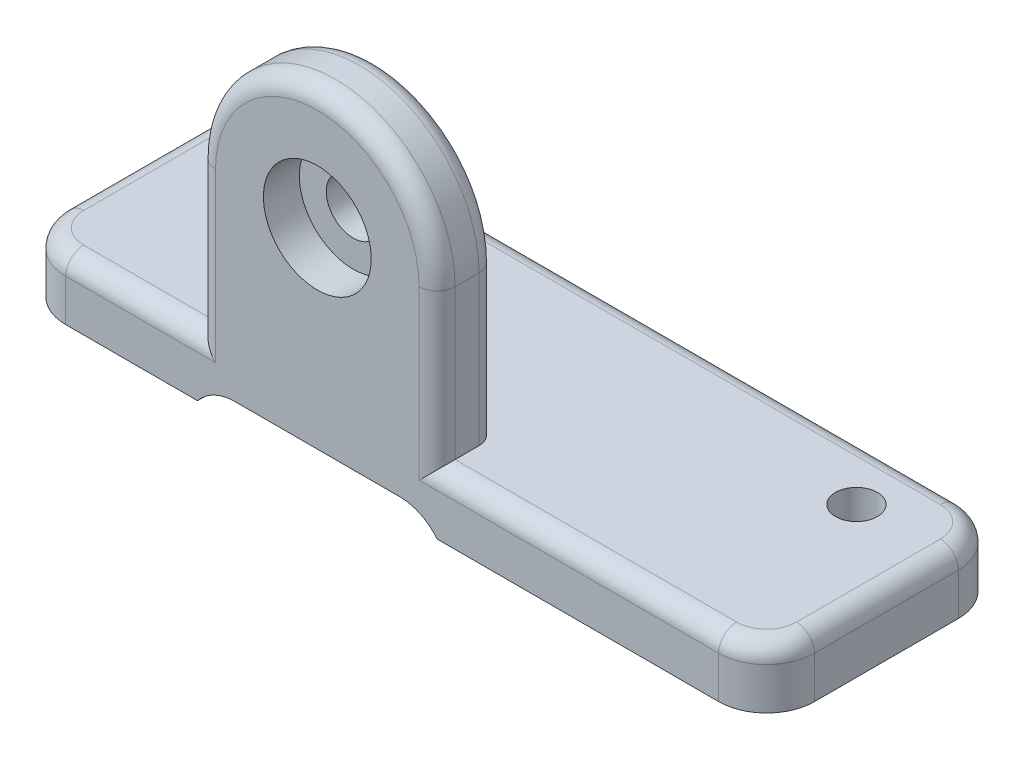
ISO-10303-21;
HEADER;
FILE_DESCRIPTION(('STEP AP214'),'2;1');
FILE_NAME('part.step','',(''),(''),'','','');
FILE_SCHEMA(('AUTOMOTIVE_DESIGN { 1 0 10303 214 1 1 1 1 }'));
ENDSEC;
DATA;
#1=APPLICATION_CONTEXT('core data for automotive mechanical design processes');
#2=APPLICATION_PROTOCOL_DEFINITION('international standard','automotive_design',2000,#1);
#3=PRODUCT_CONTEXT('',#1,'mechanical');
#4=PRODUCT('Part','Part','',(#3));
#5=PRODUCT_RELATED_PRODUCT_CATEGORY('part','',(#4));
#6=PRODUCT_DEFINITION_FORMATION('','',#4);
#7=PRODUCT_DEFINITION_CONTEXT('part definition',#1,'design');
#8=PRODUCT_DEFINITION('design','',#6,#7);
#9=PRODUCT_DEFINITION_SHAPE('','',#8);
#10=(LENGTH_UNIT() NAMED_UNIT(*) SI_UNIT(.MILLI.,.METRE.));
#11=(NAMED_UNIT(*) PLANE_ANGLE_UNIT() SI_UNIT($,.RADIAN.));
#12=(NAMED_UNIT(*) SI_UNIT($,.STERADIAN.) SOLID_ANGLE_UNIT());
#13=UNCERTAINTY_MEASURE_WITH_UNIT(LENGTH_MEASURE(1.E-05),#10,'distance_accuracy_value','');
#14=(GEOMETRIC_REPRESENTATION_CONTEXT(3) GLOBAL_UNCERTAINTY_ASSIGNED_CONTEXT((#13)) GLOBAL_UNIT_ASSIGNED_CONTEXT((#10,
#11,#12)) REPRESENTATION_CONTEXT('',''));
#15=CARTESIAN_POINT('',(0.,0.,0.));
#16=DIRECTION('',(0.,0.,1.));
#17=DIRECTION('',(1.,0.,0.));
#18=AXIS2_PLACEMENT_3D('',#15,#16,#17);
#19=CARTESIAN_POINT('',(0.,0.,40.));
#20=DIRECTION('',(0.,-1.,0.));
#21=DIRECTION('',(0.,0.,-1.));
#22=AXIS2_PLACEMENT_3D('',#19,#20,#21);
#23=PLANE('',#22);
#24=CARTESIAN_POINT('',(-15.,0.,10.));
#25=DIRECTION('',(0.,1.,0.));
#26=DIRECTION('',(0.,0.,1.));
#27=AXIS2_PLACEMENT_3D('',#24,#25,#26);
#28=CIRCLE('',#27,3.5);
#29=CARTESIAN_POINT('',(-15.,0.,13.5));
#30=VERTEX_POINT('',#29);
#31=EDGE_CURVE('E843',#30,#30,#28,.T.);
#32=ORIENTED_EDGE('',*,*,#31,.F.);
#33=EDGE_LOOP('',(#32));
#34=FACE_BOUND('',#33,.T.);
#35=CARTESIAN_POINT('',(-110.,0.,10.));
#36=DIRECTION('',(0.,1.,0.));
#37=DIRECTION('',(0.,0.,1.));
#38=AXIS2_PLACEMENT_3D('',#35,#36,#37);
#39=CIRCLE('',#38,3.50000000000001);
#40=CARTESIAN_POINT('',(-110.,0.,13.5));
#41=VERTEX_POINT('',#40);
#42=EDGE_CURVE('E840',#41,#41,#39,.T.);
#43=ORIENTED_EDGE('',*,*,#42,.F.);
#44=EDGE_LOOP('',(#43));
#45=FACE_BOUND('',#44,.T.);
#46=DIRECTION('',(0.,0.,-1.));
#47=VECTOR('',#46,1.);
#48=CARTESIAN_POINT('',(-55.,0.,40.));
#49=LINE('',#48,#47);
#50=CARTESIAN_POINT('',(-55.,0.,37.));
#51=VERTEX_POINT('',#50);
#52=CARTESIAN_POINT('',(-55.,0.,33.));
#53=VERTEX_POINT('',#52);
#54=EDGE_CURVE('E410',#51,#53,#49,.T.);
#55=ORIENTED_EDGE('',*,*,#54,.F.);
#56=DIRECTION('',(-1.,0.,0.));
#57=VECTOR('',#56,1.);
#58=CARTESIAN_POINT('',(-8.,0.,37.));
#59=LINE('',#58,#57);
#60=CARTESIAN_POINT('',(-8.,0.,37.));
#61=VERTEX_POINT('',#60);
#62=EDGE_CURVE('E331',#51,#61,#59,.F.);
#63=ORIENTED_EDGE('',*,*,#62,.T.);
#64=CARTESIAN_POINT('',(-8.,0.,32.));
#65=DIRECTION('',(0.,-1.,0.));
#66=DIRECTION('',(0.,0.,-1.));
#67=AXIS2_PLACEMENT_3D('',#64,#65,#66);
#68=CIRCLE('',#67,5.);
#69=CARTESIAN_POINT('',(-3.,0.,32.));
#70=VERTEX_POINT('',#69);
#71=EDGE_CURVE('E329',#61,#70,#68,.F.);
#72=ORIENTED_EDGE('',*,*,#71,.T.);
#73=DIRECTION('',(0.,0.,-1.));
#74=VECTOR('',#73,1.);
#75=CARTESIAN_POINT('',(-3.,0.,40.));
#76=LINE('',#75,#74);
#77=CARTESIAN_POINT('',(-3.,0.,8.));
#78=VERTEX_POINT('',#77);
#79=EDGE_CURVE('E327',#70,#78,#76,.T.);
#80=ORIENTED_EDGE('',*,*,#79,.T.);
#81=CARTESIAN_POINT('',(-8.,0.,8.));
#82=DIRECTION('',(0.,-1.,0.));
#83=DIRECTION('',(0.,0.,-1.));
#84=AXIS2_PLACEMENT_3D('',#81,#82,#83);
#85=CIRCLE('',#84,5.);
#86=CARTESIAN_POINT('',(-8.,0.,3.));
#87=VERTEX_POINT('',#86);
#88=EDGE_CURVE('E325',#78,#87,#85,.F.);
#89=ORIENTED_EDGE('',*,*,#88,.T.);
#90=DIRECTION('',(-1.,0.,0.));
#91=VECTOR('',#90,1.);
#92=CARTESIAN_POINT('',(0.,0.,3.));
#93=LINE('',#92,#91);
#94=CARTESIAN_POINT('',(-117.,0.,3.));
#95=VERTEX_POINT('',#94);
#96=EDGE_CURVE('E323',#87,#95,#93,.T.);
#97=ORIENTED_EDGE('',*,*,#96,.T.);
#98=CARTESIAN_POINT('',(-117.,0.,8.));
#99=DIRECTION('',(0.,-1.,0.));
#100=DIRECTION('',(0.,0.,-1.));
#101=AXIS2_PLACEMENT_3D('',#98,#99,#100);
#102=CIRCLE('',#101,5.);
#103=CARTESIAN_POINT('',(-122.,0.,8.));
#104=VERTEX_POINT('',#103);
#105=EDGE_CURVE('E321',#95,#104,#102,.F.);
#106=ORIENTED_EDGE('',*,*,#105,.T.);
#107=DIRECTION('',(0.,0.,-1.));
#108=VECTOR('',#107,1.);
#109=CARTESIAN_POINT('',(-122.,0.,40.));
#110=LINE('',#109,#108);
#111=CARTESIAN_POINT('',(-122.,0.,32.));
#112=VERTEX_POINT('',#111);
#113=EDGE_CURVE('E319',#104,#112,#110,.F.);
#114=ORIENTED_EDGE('',*,*,#113,.T.);
#115=CARTESIAN_POINT('',(-117.,0.,32.));
#116=DIRECTION('',(0.,-1.,0.));
#117=DIRECTION('',(0.,0.,-1.));
#118=AXIS2_PLACEMENT_3D('',#115,#116,#117);
#119=CIRCLE('',#118,5.);
#120=CARTESIAN_POINT('',(-117.,0.,37.));
#121=VERTEX_POINT('',#120);
#122=EDGE_CURVE('E317',#112,#121,#119,.F.);
#123=ORIENTED_EDGE('',*,*,#122,.T.);
#124=DIRECTION('',(-1.,0.,0.));
#125=VECTOR('',#124,1.);
#126=CARTESIAN_POINT('',(-95.,0.,37.));
#127=LINE('',#126,#125);
#128=CARTESIAN_POINT('',(-95.,0.,37.));
#129=VERTEX_POINT('',#128);
#130=EDGE_CURVE('E315',#121,#129,#127,.F.);
#131=ORIENTED_EDGE('',*,*,#130,.T.);
#132=DIRECTION('',(0.,0.,1.));
#133=VECTOR('',#132,1.);
#134=CARTESIAN_POINT('',(-95.,0.,40.));
#135=LINE('',#134,#133);
#136=CARTESIAN_POINT('',(-95.,0.,33.));
#137=VERTEX_POINT('',#136);
#138=EDGE_CURVE('E414',#137,#129,#135,.T.);
#139=ORIENTED_EDGE('',*,*,#138,.F.);
#140=CARTESIAN_POINT('',(-92.,0.,33.));
#141=DIRECTION('',(0.,-1.,0.));
#142=DIRECTION('',(0.,0.,-1.));
#143=AXIS2_PLACEMENT_3D('',#140,#141,#142);
#144=CIRCLE('',#143,3.);
#145=CARTESIAN_POINT('',(-92.,0.,30.));
#146=VERTEX_POINT('',#145);
#147=EDGE_CURVE('E225',#137,#146,#144,.T.);
#148=ORIENTED_EDGE('',*,*,#147,.T.);
#149=DIRECTION('',(-1.,0.,0.));
#150=VECTOR('',#149,1.);
#151=CARTESIAN_POINT('',(-95.,0.,30.));
#152=LINE('',#151,#150);
#153=CARTESIAN_POINT('',(-58.,0.,30.));
#154=VERTEX_POINT('',#153);
#155=EDGE_CURVE('E404',#154,#146,#152,.T.);
#156=ORIENTED_EDGE('',*,*,#155,.F.);
#157=CARTESIAN_POINT('',(-58.,0.,33.));
#158=DIRECTION('',(0.,-1.,0.));
#159=DIRECTION('',(0.,0.,-1.));
#160=AXIS2_PLACEMENT_3D('',#157,#158,#159);
#161=CIRCLE('',#160,3.);
#162=EDGE_CURVE('E221',#154,#53,#161,.T.);
#163=ORIENTED_EDGE('',*,*,#162,.T.);
#164=EDGE_LOOP('',(#55,#63,#72,#80,#89,#97,#106,#114,#123,#131,#139,#148,#156,#163));
#165=FACE_BOUND('',#164,.T.);
#166=ADVANCED_FACE('F38',(#34,#45,#165),#23,.F.);
#167=CARTESIAN_POINT('',(-125.,0.,40.));
#168=DIRECTION('',(1.,0.,0.));
#169=DIRECTION('',(0.,0.,-1.));
#170=AXIS2_PLACEMENT_3D('',#167,#168,#169);
#171=PLANE('',#170);
#172=DIRECTION('',(0.,-1.,0.));
#173=VECTOR('',#172,1.);
#174=CARTESIAN_POINT('',(-125.,0.,32.));
#175=LINE('',#174,#173);
#176=CARTESIAN_POINT('',(-125.,-10.,32.));
#177=VERTEX_POINT('',#176);
#178=CARTESIAN_POINT('',(-125.,-3.,32.));
#179=VERTEX_POINT('',#178);
#180=EDGE_CURVE('E281',#177,#179,#175,.F.);
#181=ORIENTED_EDGE('',*,*,#180,.T.);
#182=DIRECTION('',(0.,0.,-1.));
#183=VECTOR('',#182,1.);
#184=CARTESIAN_POINT('',(-125.,-3.,40.));
#185=LINE('',#184,#183);
#186=CARTESIAN_POINT('',(-125.,-3.,8.));
#187=VERTEX_POINT('',#186);
#188=EDGE_CURVE('E343',#179,#187,#185,.T.);
#189=ORIENTED_EDGE('',*,*,#188,.T.);
#190=DIRECTION('',(0.,-1.,0.));
#191=VECTOR('',#190,1.);
#192=CARTESIAN_POINT('',(-125.,0.,8.));
#193=LINE('',#192,#191);
#194=CARTESIAN_POINT('',(-125.,-10.,8.));
#195=VERTEX_POINT('',#194);
#196=EDGE_CURVE('E279',#187,#195,#193,.T.);
#197=ORIENTED_EDGE('',*,*,#196,.T.);
#198=DIRECTION('',(0.,0.,-1.));
#199=VECTOR('',#198,1.);
#200=CARTESIAN_POINT('',(-125.,-10.,40.));
#201=LINE('',#200,#199);
#202=EDGE_CURVE('E214',#177,#195,#201,.T.);
#203=ORIENTED_EDGE('',*,*,#202,.F.);
#204=EDGE_LOOP('',(#181,#189,#197,#203));
#205=FACE_BOUND('',#204,.T.);
#206=ADVANCED_FACE('F474',(#205),#171,.F.);
#207=CARTESIAN_POINT('',(-125.,-10.,40.));
#208=DIRECTION('',(0.,1.,0.));
#209=DIRECTION('',(0.,0.,1.));
#210=AXIS2_PLACEMENT_3D('',#207,#208,#209);
#211=PLANE('',#210);
#212=CARTESIAN_POINT('',(-110.,-10.,10.));
#213=DIRECTION('',(0.,1.,0.));
#214=DIRECTION('',(0.,0.,1.));
#215=AXIS2_PLACEMENT_3D('',#212,#213,#214);
#216=CIRCLE('',#215,3.50000000000001);
#217=CARTESIAN_POINT('',(-110.,-10.,13.5));
#218=VERTEX_POINT('',#217);
#219=EDGE_CURVE('E381',#218,#218,#216,.T.);
#220=ORIENTED_EDGE('',*,*,#219,.T.);
#221=EDGE_LOOP('',(#220));
#222=FACE_BOUND('',#221,.T.);
#223=DIRECTION('',(1.,0.,0.));
#224=VECTOR('',#223,1.);
#225=CARTESIAN_POINT('',(-125.,-10.,40.));
#226=LINE('',#225,#224);
#227=CARTESIAN_POINT('',(-117.,-10.,40.));
#228=VERTEX_POINT('',#227);
#229=CARTESIAN_POINT('',(-95.,-10.,40.));
#230=VERTEX_POINT('',#229);
#231=EDGE_CURVE('E196',#228,#230,#226,.T.);
#232=ORIENTED_EDGE('',*,*,#231,.F.);
#233=CARTESIAN_POINT('',(-117.,-10.,32.));
#234=DIRECTION('',(0.,1.,0.));
#235=DIRECTION('',(0.,0.,1.));
#236=AXIS2_PLACEMENT_3D('',#233,#234,#235);
#237=CIRCLE('',#236,8.);
#238=EDGE_CURVE('E277',#228,#177,#237,.F.);
#239=ORIENTED_EDGE('',*,*,#238,.T.);
#240=ORIENTED_EDGE('',*,*,#202,.T.);
#241=CARTESIAN_POINT('',(-117.,-10.,8.));
#242=DIRECTION('',(0.,1.,0.));
#243=DIRECTION('',(0.,0.,1.));
#244=AXIS2_PLACEMENT_3D('',#241,#242,#243);
#245=CIRCLE('',#244,8.);
#246=CARTESIAN_POINT('',(-117.,-10.,0.));
#247=VERTEX_POINT('',#246);
#248=EDGE_CURVE('E275',#195,#247,#245,.F.);
#249=ORIENTED_EDGE('',*,*,#248,.T.);
#250=DIRECTION('',(1.,0.,0.));
#251=VECTOR('',#250,1.);
#252=CARTESIAN_POINT('',(-125.,-10.,0.));
#253=LINE('',#252,#251);
#254=CARTESIAN_POINT('',(-95.,-10.,0.));
#255=VERTEX_POINT('',#254);
#256=EDGE_CURVE('E212',#247,#255,#253,.T.);
#257=ORIENTED_EDGE('',*,*,#256,.T.);
#258=DIRECTION('',(0.,0.,-1.));
#259=VECTOR('',#258,1.);
#260=CARTESIAN_POINT('',(-95.,-10.,40.));
#261=LINE('',#260,#259);
#262=EDGE_CURVE('E209',#230,#255,#261,.T.);
#263=ORIENTED_EDGE('',*,*,#262,.F.);
#264=EDGE_LOOP('',(#232,#239,#240,#249,#257,#263));
#265=FACE_BOUND('',#264,.T.);
#266=ADVANCED_FACE('F210',(#222,#265),#211,.F.);
#267=CARTESIAN_POINT('',(-95.,-7.,40.));
#268=DIRECTION('',(0.,1.,0.));
#269=DIRECTION('',(-1.,0.,0.));
#270=AXIS2_PLACEMENT_3D('',#267,#268,#269);
#271=PLANE('',#270);
#272=DIRECTION('',(1.,0.,0.));
#273=VECTOR('',#272,1.);
#274=CARTESIAN_POINT('',(-95.,-7.,0.));
#275=LINE('',#274,#273);
#276=CARTESIAN_POINT('',(-88.7550020016016,-7.,0.));
#277=VERTEX_POINT('',#276);
#278=CARTESIAN_POINT('',(-61.2449979983984,-7.,0.));
#279=VERTEX_POINT('',#278);
#280=EDGE_CURVE('E237',#277,#279,#275,.T.);
#281=ORIENTED_EDGE('',*,*,#280,.T.);
#282=DIRECTION('',(0.,0.,1.));
#283=VECTOR('',#282,1.);
#284=CARTESIAN_POINT('',(-61.2449979983984,-7.,40.));
#285=LINE('',#284,#283);
#286=CARTESIAN_POINT('',(-61.2449979983984,-7.,40.));
#287=VERTEX_POINT('',#286);
#288=EDGE_CURVE('E53',#279,#287,#285,.T.);
#289=ORIENTED_EDGE('',*,*,#288,.T.);
#290=DIRECTION('',(1.,0.,0.));
#291=VECTOR('',#290,1.);
#292=CARTESIAN_POINT('',(-95.,-7.,40.));
#293=LINE('',#292,#291);
#294=CARTESIAN_POINT('',(-88.7550020016016,-7.,40.));
#295=VERTEX_POINT('',#294);
#296=EDGE_CURVE('E204',#295,#287,#293,.T.);
#297=ORIENTED_EDGE('',*,*,#296,.F.);
#298=DIRECTION('',(0.,0.,-1.));
#299=VECTOR('',#298,1.);
#300=CARTESIAN_POINT('',(-88.7550020016016,-7.,40.));
#301=LINE('',#300,#299);
#302=EDGE_CURVE('E219',#295,#277,#301,.T.);
#303=ORIENTED_EDGE('',*,*,#302,.T.);
#304=EDGE_LOOP('',(#281,#289,#297,#303));
#305=FACE_BOUND('',#304,.T.);
#306=ADVANCED_FACE('F531',(#305),#271,.F.);
#307=CARTESIAN_POINT('',(-55.,-10.,40.));
#308=DIRECTION('',(0.,1.,0.));
#309=DIRECTION('',(-1.,0.,0.));
#310=AXIS2_PLACEMENT_3D('',#307,#308,#309);
#311=PLANE('',#310);
#312=CARTESIAN_POINT('',(-15.,-10.,10.));
#313=DIRECTION('',(0.,1.,0.));
#314=DIRECTION('',(0.,0.,1.));
#315=AXIS2_PLACEMENT_3D('',#312,#313,#314);
#316=CIRCLE('',#315,3.5);
#317=CARTESIAN_POINT('',(-15.,-10.,13.5));
#318=VERTEX_POINT('',#317);
#319=EDGE_CURVE('E837',#318,#318,#316,.T.);
#320=ORIENTED_EDGE('',*,*,#319,.T.);
#321=EDGE_LOOP('',(#320));
#322=FACE_BOUND('',#321,.T.);
#323=DIRECTION('',(1.,0.,0.));
#324=VECTOR('',#323,1.);
#325=CARTESIAN_POINT('',(-55.,-10.,0.));
#326=LINE('',#325,#324);
#327=CARTESIAN_POINT('',(-55.,-10.,0.));
#328=VERTEX_POINT('',#327);
#329=CARTESIAN_POINT('',(-8.,-10.,0.));
#330=VERTEX_POINT('',#329);
#331=EDGE_CURVE('E205',#328,#330,#326,.T.);
#332=ORIENTED_EDGE('',*,*,#331,.T.);
#333=CARTESIAN_POINT('',(-8.,-10.,8.));
#334=DIRECTION('',(0.,1.,0.));
#335=DIRECTION('',(-1.,0.,0.));
#336=AXIS2_PLACEMENT_3D('',#333,#334,#335);
#337=CIRCLE('',#336,8.);
#338=CARTESIAN_POINT('',(0.,-10.,8.));
#339=VERTEX_POINT('',#338);
#340=EDGE_CURVE('E270',#330,#339,#337,.F.);
#341=ORIENTED_EDGE('',*,*,#340,.T.);
#342=DIRECTION('',(0.,0.,-1.));
#343=VECTOR('',#342,1.);
#344=CARTESIAN_POINT('',(0.,-10.,40.));
#345=LINE('',#344,#343);
#346=CARTESIAN_POINT('',(0.,-10.,32.));
#347=VERTEX_POINT('',#346);
#348=EDGE_CURVE('E246',#347,#339,#345,.T.);
#349=ORIENTED_EDGE('',*,*,#348,.F.);
#350=CARTESIAN_POINT('',(-8.,-10.,32.));
#351=DIRECTION('',(0.,1.,0.));
#352=DIRECTION('',(-1.,0.,0.));
#353=AXIS2_PLACEMENT_3D('',#350,#351,#352);
#354=CIRCLE('',#353,8.);
#355=CARTESIAN_POINT('',(-8.,-10.,40.));
#356=VERTEX_POINT('',#355);
#357=EDGE_CURVE('E268',#347,#356,#354,.F.);
#358=ORIENTED_EDGE('',*,*,#357,.T.);
#359=DIRECTION('',(1.,0.,0.));
#360=VECTOR('',#359,1.);
#361=CARTESIAN_POINT('',(-55.,-10.,40.));
#362=LINE('',#361,#360);
#363=CARTESIAN_POINT('',(-55.,-10.,40.));
#364=VERTEX_POINT('',#363);
#365=EDGE_CURVE('E249',#364,#356,#362,.T.);
#366=ORIENTED_EDGE('',*,*,#365,.F.);
#367=DIRECTION('',(0.,0.,-1.));
#368=VECTOR('',#367,1.);
#369=CARTESIAN_POINT('',(-55.,-10.,40.));
#370=LINE('',#369,#368);
#371=EDGE_CURVE('E215',#364,#328,#370,.T.);
#372=ORIENTED_EDGE('',*,*,#371,.T.);
#373=EDGE_LOOP('',(#332,#341,#349,#358,#366,#372));
#374=FACE_BOUND('',#373,.T.);
#375=ADVANCED_FACE('F496',(#322,#374),#311,.F.);
#376=CARTESIAN_POINT('',(0.,-10.,40.));
#377=DIRECTION('',(-1.,0.,0.));
#378=DIRECTION('',(0.,0.,1.));
#379=AXIS2_PLACEMENT_3D('',#376,#377,#378);
#380=PLANE('',#379);
#381=DIRECTION('',(0.,1.,0.));
#382=VECTOR('',#381,1.);
#383=CARTESIAN_POINT('',(0.,-10.,8.));
#384=LINE('',#383,#382);
#385=CARTESIAN_POINT('',(0.,-3.,8.));
#386=VERTEX_POINT('',#385);
#387=EDGE_CURVE('E261',#339,#386,#384,.T.);
#388=ORIENTED_EDGE('',*,*,#387,.T.);
#389=DIRECTION('',(0.,0.,-1.));
#390=VECTOR('',#389,1.);
#391=CARTESIAN_POINT('',(0.,-3.,40.));
#392=LINE('',#391,#390);
#393=CARTESIAN_POINT('',(0.,-3.,32.));
#394=VERTEX_POINT('',#393);
#395=EDGE_CURVE('E335',#386,#394,#392,.F.);
#396=ORIENTED_EDGE('',*,*,#395,.T.);
#397=DIRECTION('',(0.,1.,0.));
#398=VECTOR('',#397,1.);
#399=CARTESIAN_POINT('',(0.,-10.,32.));
#400=LINE('',#399,#398);
#401=EDGE_CURVE('E254',#394,#347,#400,.F.);
#402=ORIENTED_EDGE('',*,*,#401,.T.);
#403=ORIENTED_EDGE('',*,*,#348,.T.);
#404=EDGE_LOOP('',(#388,#396,#402,#403));
#405=FACE_BOUND('',#404,.T.);
#406=ADVANCED_FACE('F498',(#405),#380,.F.);
#407=CARTESIAN_POINT('',(0.,0.,40.));
#408=DIRECTION('',(0.,0.,1.));
#409=DIRECTION('',(1.,0.,0.));
#410=AXIS2_PLACEMENT_3D('',#407,#408,#409);
#411=PLANE('',#410);
#412=CARTESIAN_POINT('',(-75.,25.,40.));
#413=DIRECTION('',(0.,0.,1.));
#414=DIRECTION('',(1.,0.,0.));
#415=AXIS2_PLACEMENT_3D('',#412,#413,#414);
#416=CIRCLE('',#415,9.);
#417=CARTESIAN_POINT('',(-66.,25.,40.));
#418=VERTEX_POINT('',#417);
#419=EDGE_CURVE('E258',#418,#418,#416,.T.);
#420=ORIENTED_EDGE('',*,*,#419,.F.);
#421=EDGE_LOOP('',(#420));
#422=FACE_BOUND('',#421,.T.);
#423=DIRECTION('',(0.,1.,0.));
#424=VECTOR('',#423,1.);
#425=CARTESIAN_POINT('',(-8.,0.,40.));
#426=LINE('',#425,#424);
#427=CARTESIAN_POINT('',(-8.,-3.,40.));
#428=VERTEX_POINT('',#427);
#429=EDGE_CURVE('E273',#356,#428,#426,.T.);
#430=ORIENTED_EDGE('',*,*,#429,.T.);
#431=DIRECTION('',(-1.,0.,0.));
#432=VECTOR('',#431,1.);
#433=CARTESIAN_POINT('',(-55.,-3.,40.));
#434=LINE('',#433,#432);
#435=CARTESIAN_POINT('',(-58.,-3.,40.));
#436=VERTEX_POINT('',#435);
#437=EDGE_CURVE('E298',#428,#436,#434,.T.);
#438=ORIENTED_EDGE('',*,*,#437,.T.);
#439=DIRECTION('',(0.,-1.,0.));
#440=VECTOR('',#439,1.);
#441=CARTESIAN_POINT('',(-58.,25.,40.));
#442=LINE('',#441,#440);
#443=CARTESIAN_POINT('',(-58.,25.,40.));
#444=VERTEX_POINT('',#443);
#445=EDGE_CURVE('E295',#436,#444,#442,.F.);
#446=ORIENTED_EDGE('',*,*,#445,.T.);
#447=CARTESIAN_POINT('',(-75.,25.,40.));
#448=DIRECTION('',(0.,0.,1.));
#449=DIRECTION('',(1.,0.,0.));
#450=AXIS2_PLACEMENT_3D('',#447,#448,#449);
#451=CIRCLE('',#450,17.);
#452=CARTESIAN_POINT('',(-92.,25.,40.));
#453=VERTEX_POINT('',#452);
#454=EDGE_CURVE('E293',#444,#453,#451,.T.);
#455=ORIENTED_EDGE('',*,*,#454,.T.);
#456=DIRECTION('',(0.,-1.,0.));
#457=VECTOR('',#456,1.);
#458=CARTESIAN_POINT('',(-92.,0.,40.));
#459=LINE('',#458,#457);
#460=CARTESIAN_POINT('',(-92.,-3.,40.));
#461=VERTEX_POINT('',#460);
#462=EDGE_CURVE('E291',#453,#461,#459,.T.);
#463=ORIENTED_EDGE('',*,*,#462,.T.);
#464=DIRECTION('',(-1.,0.,0.));
#465=VECTOR('',#464,1.);
#466=CARTESIAN_POINT('',(-117.,-3.,40.));
#467=LINE('',#466,#465);
#468=CARTESIAN_POINT('',(-117.,-3.,40.));
#469=VERTEX_POINT('',#468);
#470=EDGE_CURVE('E289',#461,#469,#467,.T.);
#471=ORIENTED_EDGE('',*,*,#470,.T.);
#472=DIRECTION('',(0.,-1.,0.));
#473=VECTOR('',#472,1.);
#474=CARTESIAN_POINT('',(-117.,-10.,40.));
#475=LINE('',#474,#473);
#476=EDGE_CURVE('E201',#469,#228,#475,.T.);
#477=ORIENTED_EDGE('',*,*,#476,.T.);
#478=ORIENTED_EDGE('',*,*,#231,.T.);
#479=CARTESIAN_POINT('',(-88.7550020016016,-15.,40.));
#480=DIRECTION('',(0.,0.,1.));
#481=DIRECTION('',(1.,0.,0.));
#482=AXIS2_PLACEMENT_3D('',#479,#480,#481);
#483=CIRCLE('',#482,8.);
#484=EDGE_CURVE('E11',#230,#295,#483,.F.);
#485=ORIENTED_EDGE('',*,*,#484,.T.);
#486=ORIENTED_EDGE('',*,*,#296,.T.);
#487=CARTESIAN_POINT('',(-61.2449979983984,-15.,40.));
#488=DIRECTION('',(0.,0.,1.));
#489=DIRECTION('',(1.,0.,0.));
#490=AXIS2_PLACEMENT_3D('',#487,#488,#489);
#491=CIRCLE('',#490,8.);
#492=EDGE_CURVE('E232',#287,#364,#491,.F.);
#493=ORIENTED_EDGE('',*,*,#492,.T.);
#494=ORIENTED_EDGE('',*,*,#365,.T.);
#495=EDGE_LOOP('',(#430,#438,#446,#455,#463,#471,#477,#478,#485,#486,#493,#494));
#496=FACE_BOUND('',#495,.T.);
#497=ADVANCED_FACE('F199',(#422,#496),#411,.T.);
#498=CARTESIAN_POINT('',(0.,0.,0.));
#499=DIRECTION('',(0.,0.,1.));
#500=DIRECTION('',(1.,0.,0.));
#501=AXIS2_PLACEMENT_3D('',#498,#499,#500);
#502=PLANE('',#501);
#503=DIRECTION('',(0.,-1.,0.));
#504=VECTOR('',#503,1.);
#505=CARTESIAN_POINT('',(-117.,0.,0.));
#506=LINE('',#505,#504);
#507=CARTESIAN_POINT('',(-117.,-3.,0.));
#508=VERTEX_POINT('',#507);
#509=EDGE_CURVE('E264',#247,#508,#506,.F.);
#510=ORIENTED_EDGE('',*,*,#509,.T.);
#511=DIRECTION('',(-1.,0.,0.));
#512=VECTOR('',#511,1.);
#513=CARTESIAN_POINT('',(0.,-3.,0.));
#514=LINE('',#513,#512);
#515=CARTESIAN_POINT('',(-8.,-3.,0.));
#516=VERTEX_POINT('',#515);
#517=EDGE_CURVE('E339',#508,#516,#514,.F.);
#518=ORIENTED_EDGE('',*,*,#517,.T.);
#519=DIRECTION('',(0.,1.,0.));
#520=VECTOR('',#519,1.);
#521=CARTESIAN_POINT('',(-8.,0.,0.));
#522=LINE('',#521,#520);
#523=EDGE_CURVE('E266',#516,#330,#522,.F.);
#524=ORIENTED_EDGE('',*,*,#523,.T.);
#525=ORIENTED_EDGE('',*,*,#331,.F.);
#526=CARTESIAN_POINT('',(-61.2449979983984,-15.,0.));
#527=DIRECTION('',(0.,0.,1.));
#528=DIRECTION('',(1.,0.,0.));
#529=AXIS2_PLACEMENT_3D('',#526,#527,#528);
#530=CIRCLE('',#529,8.);
#531=EDGE_CURVE('E223',#328,#279,#530,.T.);
#532=ORIENTED_EDGE('',*,*,#531,.T.);
#533=ORIENTED_EDGE('',*,*,#280,.F.);
#534=CARTESIAN_POINT('',(-88.7550020016016,-15.,0.));
#535=DIRECTION('',(0.,0.,1.));
#536=DIRECTION('',(1.,0.,0.));
#537=AXIS2_PLACEMENT_3D('',#534,#535,#536);
#538=CIRCLE('',#537,8.);
#539=EDGE_CURVE('E46',#277,#255,#538,.T.);
#540=ORIENTED_EDGE('',*,*,#539,.T.);
#541=ORIENTED_EDGE('',*,*,#256,.F.);
#542=EDGE_LOOP('',(#510,#518,#524,#525,#532,#533,#540,#541));
#543=FACE_BOUND('',#542,.T.);
#544=ADVANCED_FACE('F235',(#543),#502,.F.);
#545=CARTESIAN_POINT('',(-95.,25.,40.));
#546=DIRECTION('',(1.,0.,0.));
#547=DIRECTION('',(0.,0.,-1.));
#548=AXIS2_PLACEMENT_3D('',#545,#546,#547);
#549=PLANE('',#548);
#550=DIRECTION('',(0.,0.,1.));
#551=VECTOR('',#550,1.);
#552=CARTESIAN_POINT('',(-95.,25.,40.));
#553=LINE('',#552,#551);
#554=CARTESIAN_POINT('',(-95.,25.,33.));
#555=VERTEX_POINT('',#554);
#556=CARTESIAN_POINT('',(-95.,25.,37.));
#557=VERTEX_POINT('',#556);
#558=EDGE_CURVE('E409',#555,#557,#553,.T.);
#559=ORIENTED_EDGE('',*,*,#558,.F.);
#560=DIRECTION('',(0.,-1.,0.));
#561=VECTOR('',#560,1.);
#562=CARTESIAN_POINT('',(-95.,25.,33.));
#563=LINE('',#562,#561);
#564=EDGE_CURVE('E306',#555,#137,#563,.T.);
#565=ORIENTED_EDGE('',*,*,#564,.T.);
#566=ORIENTED_EDGE('',*,*,#138,.T.);
#567=DIRECTION('',(0.,-1.,0.));
#568=VECTOR('',#567,1.);
#569=CARTESIAN_POINT('',(-95.,25.,37.));
#570=LINE('',#569,#568);
#571=EDGE_CURVE('E304',#129,#557,#570,.F.);
#572=ORIENTED_EDGE('',*,*,#571,.T.);
#573=EDGE_LOOP('',(#559,#565,#566,#572));
#574=FACE_BOUND('',#573,.T.);
#575=ADVANCED_FACE('F788',(#574),#549,.F.);
#576=CARTESIAN_POINT('',(-55.,25.,40.));
#577=DIRECTION('',(-1.,0.,0.));
#578=DIRECTION('',(0.,0.,1.));
#579=AXIS2_PLACEMENT_3D('',#576,#577,#578);
#580=PLANE('',#579);
#581=DIRECTION('',(0.,0.,-1.));
#582=VECTOR('',#581,1.);
#583=CARTESIAN_POINT('',(-55.,25.,40.));
#584=LINE('',#583,#582);
#585=CARTESIAN_POINT('',(-55.,25.,37.));
#586=VERTEX_POINT('',#585);
#587=CARTESIAN_POINT('',(-55.,25.,33.));
#588=VERTEX_POINT('',#587);
#589=EDGE_CURVE('E242',#586,#588,#584,.T.);
#590=ORIENTED_EDGE('',*,*,#589,.F.);
#591=DIRECTION('',(0.,-1.,0.));
#592=VECTOR('',#591,1.);
#593=CARTESIAN_POINT('',(-55.,0.,37.));
#594=LINE('',#593,#592);
#595=EDGE_CURVE('E286',#586,#51,#594,.T.);
#596=ORIENTED_EDGE('',*,*,#595,.T.);
#597=ORIENTED_EDGE('',*,*,#54,.T.);
#598=DIRECTION('',(0.,-1.,0.));
#599=VECTOR('',#598,1.);
#600=CARTESIAN_POINT('',(-55.,25.,33.));
#601=LINE('',#600,#599);
#602=EDGE_CURVE('E284',#53,#588,#601,.F.);
#603=ORIENTED_EDGE('',*,*,#602,.T.);
#604=EDGE_LOOP('',(#590,#596,#597,#603));
#605=FACE_BOUND('',#604,.T.);
#606=ADVANCED_FACE('F761',(#605),#580,.F.);
#607=CARTESIAN_POINT('',(-95.,25.,30.));
#608=DIRECTION('',(0.,0.,1.));
#609=DIRECTION('',(1.,0.,0.));
#610=AXIS2_PLACEMENT_3D('',#607,#608,#609);
#611=PLANE('',#610);
#612=ORIENTED_EDGE('',*,*,#155,.T.);
#613=DIRECTION('',(0.,-1.,0.));
#614=VECTOR('',#613,1.);
#615=CARTESIAN_POINT('',(-92.,25.,30.));
#616=LINE('',#615,#614);
#617=CARTESIAN_POINT('',(-92.,25.,30.));
#618=VERTEX_POINT('',#617);
#619=EDGE_CURVE('E313',#146,#618,#616,.F.);
#620=ORIENTED_EDGE('',*,*,#619,.T.);
#621=CARTESIAN_POINT('',(-75.,25.,30.));
#622=DIRECTION('',(0.,0.,1.));
#623=DIRECTION('',(1.,0.,0.));
#624=AXIS2_PLACEMENT_3D('',#621,#622,#623);
#625=CIRCLE('',#624,17.);
#626=CARTESIAN_POINT('',(-58.,25.,30.));
#627=VERTEX_POINT('',#626);
#628=EDGE_CURVE('E309',#618,#627,#625,.F.);
#629=ORIENTED_EDGE('',*,*,#628,.T.);
#630=DIRECTION('',(0.,-1.,0.));
#631=VECTOR('',#630,1.);
#632=CARTESIAN_POINT('',(-58.,25.,30.));
#633=LINE('',#632,#631);
#634=EDGE_CURVE('E311',#627,#154,#633,.T.);
#635=ORIENTED_EDGE('',*,*,#634,.T.);
#636=EDGE_LOOP('',(#612,#620,#629,#635));
#637=FACE_BOUND('',#636,.T.);
#638=CARTESIAN_POINT('',(-75.,25.,30.));
#639=DIRECTION('',(0.,0.,1.));
#640=DIRECTION('',(1.,0.,0.));
#641=AXIS2_PLACEMENT_3D('',#638,#639,#640);
#642=CIRCLE('',#641,4.5);
#643=CARTESIAN_POINT('',(-70.5,25.,30.));
#644=VERTEX_POINT('',#643);
#645=EDGE_CURVE('E255',#644,#644,#642,.T.);
#646=ORIENTED_EDGE('',*,*,#645,.T.);
#647=EDGE_LOOP('',(#646));
#648=FACE_BOUND('',#647,.T.);
#649=ADVANCED_FACE('F402',(#637,#648),#611,.F.);
#650=CARTESIAN_POINT('',(-75.,25.,30.));
#651=DIRECTION('',(0.,0.,1.));
#652=DIRECTION('',(1.,0.,0.));
#653=AXIS2_PLACEMENT_3D('',#650,#651,#652);
#654=CYLINDRICAL_SURFACE('',#653,20.);
#655=ORIENTED_EDGE('',*,*,#558,.T.);
#656=CARTESIAN_POINT('',(-75.,25.,37.));
#657=DIRECTION('',(0.,0.,1.));
#658=DIRECTION('',(1.,0.,0.));
#659=AXIS2_PLACEMENT_3D('',#656,#657,#658);
#660=CIRCLE('',#659,20.);
#661=EDGE_CURVE('E302',#557,#586,#660,.F.);
#662=ORIENTED_EDGE('',*,*,#661,.T.);
#663=ORIENTED_EDGE('',*,*,#589,.T.);
#664=CARTESIAN_POINT('',(-75.,25.,33.));
#665=DIRECTION('',(0.,0.,1.));
#666=DIRECTION('',(1.,0.,0.));
#667=AXIS2_PLACEMENT_3D('',#664,#665,#666);
#668=CIRCLE('',#667,20.);
#669=EDGE_CURVE('E300',#588,#555,#668,.T.);
#670=ORIENTED_EDGE('',*,*,#669,.T.);
#671=EDGE_LOOP('',(#655,#662,#663,#670));
#672=FACE_BOUND('',#671,.T.);
#673=ADVANCED_FACE('F744',(#672),#654,.T.);
#674=CARTESIAN_POINT('',(-75.,25.,34.));
#675=DIRECTION('',(0.,0.,1.));
#676=DIRECTION('',(1.,0.,0.));
#677=AXIS2_PLACEMENT_3D('',#674,#675,#676);
#678=CYLINDRICAL_SURFACE('',#677,9.);
#679=CARTESIAN_POINT('',(-75.,25.,34.));
#680=DIRECTION('',(0.,0.,1.));
#681=DIRECTION('',(1.,0.,0.));
#682=AXIS2_PLACEMENT_3D('',#679,#680,#681);
#683=CIRCLE('',#682,9.);
#684=CARTESIAN_POINT('',(-66.,25.,34.));
#685=VERTEX_POINT('',#684);
#686=EDGE_CURVE('E828',#685,#685,#683,.T.);
#687=ORIENTED_EDGE('',*,*,#686,.F.);
#688=EDGE_LOOP('',(#687));
#689=FACE_BOUND('',#688,.T.);
#690=ORIENTED_EDGE('',*,*,#419,.T.);
#691=EDGE_LOOP('',(#690));
#692=FACE_BOUND('',#691,.T.);
#693=ADVANCED_FACE('F735',(#689,#692),#678,.F.);
#694=CARTESIAN_POINT('',(-75.,25.,34.));
#695=DIRECTION('',(0.,0.,1.));
#696=DIRECTION('',(1.,0.,0.));
#697=AXIS2_PLACEMENT_3D('',#694,#695,#696);
#698=PLANE('',#697);
#699=CARTESIAN_POINT('',(-75.,25.,34.));
#700=DIRECTION('',(0.,0.,1.));
#701=DIRECTION('',(1.,0.,0.));
#702=AXIS2_PLACEMENT_3D('',#699,#700,#701);
#703=CIRCLE('',#702,4.5);
#704=CARTESIAN_POINT('',(-70.5,25.,34.));
#705=VERTEX_POINT('',#704);
#706=EDGE_CURVE('E259',#705,#705,#703,.T.);
#707=ORIENTED_EDGE('',*,*,#706,.F.);
#708=EDGE_LOOP('',(#707));
#709=FACE_BOUND('',#708,.T.);
#710=ORIENTED_EDGE('',*,*,#686,.T.);
#711=EDGE_LOOP('',(#710));
#712=FACE_BOUND('',#711,.T.);
#713=ADVANCED_FACE('F726',(#709,#712),#698,.T.);
#714=CARTESIAN_POINT('',(-75.,25.,0.));
#715=DIRECTION('',(0.,0.,1.));
#716=DIRECTION('',(1.,0.,0.));
#717=AXIS2_PLACEMENT_3D('',#714,#715,#716);
#718=CYLINDRICAL_SURFACE('',#717,4.5);
#719=ORIENTED_EDGE('',*,*,#706,.T.);
#720=EDGE_LOOP('',(#719));
#721=FACE_BOUND('',#720,.T.);
#722=ORIENTED_EDGE('',*,*,#645,.F.);
#723=EDGE_LOOP('',(#722));
#724=FACE_BOUND('',#723,.T.);
#725=ADVANCED_FACE('F717',(#721,#724),#718,.F.);
#726=CARTESIAN_POINT('',(-15.,-10.,10.));
#727=DIRECTION('',(0.,1.,0.));
#728=DIRECTION('',(0.,0.,1.));
#729=AXIS2_PLACEMENT_3D('',#726,#727,#728);
#730=CYLINDRICAL_SURFACE('',#729,3.5);
#731=ORIENTED_EDGE('',*,*,#319,.F.);
#732=EDGE_LOOP('',(#731));
#733=FACE_BOUND('',#732,.T.);
#734=ORIENTED_EDGE('',*,*,#31,.T.);
#735=EDGE_LOOP('',(#734));
#736=FACE_BOUND('',#735,.T.);
#737=ADVANCED_FACE('F708',(#733,#736),#730,.F.);
#738=CARTESIAN_POINT('',(-110.,-10.,10.));
#739=DIRECTION('',(0.,1.,0.));
#740=DIRECTION('',(0.,0.,1.));
#741=AXIS2_PLACEMENT_3D('',#738,#739,#740);
#742=CYLINDRICAL_SURFACE('',#741,3.50000000000001);
#743=ORIENTED_EDGE('',*,*,#219,.F.);
#744=EDGE_LOOP('',(#743));
#745=FACE_BOUND('',#744,.T.);
#746=ORIENTED_EDGE('',*,*,#42,.T.);
#747=EDGE_LOOP('',(#746));
#748=FACE_BOUND('',#747,.T.);
#749=ADVANCED_FACE('F540',(#745,#748),#742,.F.);
#750=CARTESIAN_POINT('',(-8.,-10.,8.));
#751=DIRECTION('',(0.,1.,0.));
#752=DIRECTION('',(0.,0.,1.));
#753=AXIS2_PLACEMENT_3D('',#750,#751,#752);
#754=CYLINDRICAL_SURFACE('',#753,8.);
#755=ORIENTED_EDGE('',*,*,#523,.F.);
#756=CARTESIAN_POINT('',(-8.,-3.,8.));
#757=DIRECTION('',(0.,-1.,0.));
#758=DIRECTION('',(0.,0.,-1.));
#759=AXIS2_PLACEMENT_3D('',#756,#757,#758);
#760=CIRCLE('',#759,8.);
#761=EDGE_CURVE('E337',#516,#386,#760,.T.);
#762=ORIENTED_EDGE('',*,*,#761,.T.);
#763=ORIENTED_EDGE('',*,*,#387,.F.);
#764=ORIENTED_EDGE('',*,*,#340,.F.);
#765=EDGE_LOOP('',(#755,#762,#763,#764));
#766=FACE_BOUND('',#765,.T.);
#767=ADVANCED_FACE('F493',(#766),#754,.T.);
#768=CARTESIAN_POINT('',(-8.,0.,32.));
#769=DIRECTION('',(0.,-1.,0.));
#770=DIRECTION('',(0.,0.,-1.));
#771=AXIS2_PLACEMENT_3D('',#768,#769,#770);
#772=CYLINDRICAL_SURFACE('',#771,8.);
#773=ORIENTED_EDGE('',*,*,#401,.F.);
#774=CARTESIAN_POINT('',(-8.,-3.,32.));
#775=DIRECTION('',(0.,-1.,0.));
#776=DIRECTION('',(0.,0.,-1.));
#777=AXIS2_PLACEMENT_3D('',#774,#775,#776);
#778=CIRCLE('',#777,8.);
#779=EDGE_CURVE('E333',#394,#428,#778,.T.);
#780=ORIENTED_EDGE('',*,*,#779,.T.);
#781=ORIENTED_EDGE('',*,*,#429,.F.);
#782=ORIENTED_EDGE('',*,*,#357,.F.);
#783=EDGE_LOOP('',(#773,#780,#781,#782));
#784=FACE_BOUND('',#783,.T.);
#785=ADVANCED_FACE('F428',(#784),#772,.T.);
#786=CARTESIAN_POINT('',(-117.,0.,32.));
#787=DIRECTION('',(0.,1.,0.));
#788=DIRECTION('',(0.,0.,1.));
#789=AXIS2_PLACEMENT_3D('',#786,#787,#788);
#790=CYLINDRICAL_SURFACE('',#789,8.);
#791=ORIENTED_EDGE('',*,*,#476,.F.);
#792=CARTESIAN_POINT('',(-117.,-3.,32.));
#793=DIRECTION('',(0.,-1.,0.));
#794=DIRECTION('',(0.,0.,-1.));
#795=AXIS2_PLACEMENT_3D('',#792,#793,#794);
#796=CIRCLE('',#795,8.);
#797=EDGE_CURVE('E345',#469,#179,#796,.T.);
#798=ORIENTED_EDGE('',*,*,#797,.T.);
#799=ORIENTED_EDGE('',*,*,#180,.F.);
#800=ORIENTED_EDGE('',*,*,#238,.F.);
#801=EDGE_LOOP('',(#791,#798,#799,#800));
#802=FACE_BOUND('',#801,.T.);
#803=ADVANCED_FACE('F461',(#802),#790,.T.);
#804=CARTESIAN_POINT('',(-117.,0.,8.));
#805=DIRECTION('',(0.,-1.,0.));
#806=DIRECTION('',(0.,0.,-1.));
#807=AXIS2_PLACEMENT_3D('',#804,#805,#806);
#808=CYLINDRICAL_SURFACE('',#807,8.);
#809=ORIENTED_EDGE('',*,*,#196,.F.);
#810=CARTESIAN_POINT('',(-117.,-3.,8.));
#811=DIRECTION('',(0.,-1.,0.));
#812=DIRECTION('',(0.,0.,-1.));
#813=AXIS2_PLACEMENT_3D('',#810,#811,#812);
#814=CIRCLE('',#813,8.);
#815=EDGE_CURVE('E341',#187,#508,#814,.T.);
#816=ORIENTED_EDGE('',*,*,#815,.T.);
#817=ORIENTED_EDGE('',*,*,#509,.F.);
#818=ORIENTED_EDGE('',*,*,#248,.F.);
#819=EDGE_LOOP('',(#809,#816,#817,#818));
#820=FACE_BOUND('',#819,.T.);
#821=ADVANCED_FACE('F479',(#820),#808,.T.);
#822=CARTESIAN_POINT('',(-117.,-3.,8.));
#823=DIRECTION('',(0.,-1.,0.));
#824=DIRECTION('',(0.,0.,-1.));
#825=AXIS2_PLACEMENT_3D('',#822,#823,#824);
#826=TOROIDAL_SURFACE('',#825,5.,3.);
#827=CARTESIAN_POINT('',(-117.,-3.,3.));
#828=DIRECTION('',(1.,0.,0.));
#829=DIRECTION('',(0.,0.,-1.));
#830=AXIS2_PLACEMENT_3D('',#827,#828,#829);
#831=CIRCLE('',#830,3.);
#832=EDGE_CURVE('E376',#508,#95,#831,.T.);
#833=ORIENTED_EDGE('',*,*,#832,.F.);
#834=ORIENTED_EDGE('',*,*,#815,.F.);
#835=CARTESIAN_POINT('',(-122.,-3.,8.));
#836=DIRECTION('',(0.,0.,1.));
#837=DIRECTION('',(1.,0.,0.));
#838=AXIS2_PLACEMENT_3D('',#835,#836,#837);
#839=CIRCLE('',#838,3.);
#840=EDGE_CURVE('E379',#104,#187,#839,.T.);
#841=ORIENTED_EDGE('',*,*,#840,.F.);
#842=ORIENTED_EDGE('',*,*,#105,.F.);
#843=EDGE_LOOP('',(#833,#834,#841,#842));
#844=FACE_BOUND('',#843,.T.);
#845=ADVANCED_FACE('F482',(#844),#826,.T.);
#846=CARTESIAN_POINT('',(-122.,-3.,40.));
#847=DIRECTION('',(0.,0.,-1.));
#848=DIRECTION('',(-1.,0.,0.));
#849=AXIS2_PLACEMENT_3D('',#846,#847,#848);
#850=CYLINDRICAL_SURFACE('',#849,3.);
#851=ORIENTED_EDGE('',*,*,#840,.T.);
#852=ORIENTED_EDGE('',*,*,#188,.F.);
#853=CARTESIAN_POINT('',(-122.,-3.,32.));
#854=DIRECTION('',(0.,0.,1.));
#855=DIRECTION('',(1.,0.,0.));
#856=AXIS2_PLACEMENT_3D('',#853,#854,#855);
#857=CIRCLE('',#856,3.);
#858=EDGE_CURVE('E373',#112,#179,#857,.T.);
#859=ORIENTED_EDGE('',*,*,#858,.F.);
#860=ORIENTED_EDGE('',*,*,#113,.F.);
#861=EDGE_LOOP('',(#851,#852,#859,#860));
#862=FACE_BOUND('',#861,.T.);
#863=ADVANCED_FACE('F470',(#862),#850,.T.);
#864=CARTESIAN_POINT('',(0.,-3.,3.));
#865=DIRECTION('',(-1.,0.,0.));
#866=DIRECTION('',(0.,0.,1.));
#867=AXIS2_PLACEMENT_3D('',#864,#865,#866);
#868=CYLINDRICAL_SURFACE('',#867,3.);
#869=ORIENTED_EDGE('',*,*,#832,.T.);
#870=ORIENTED_EDGE('',*,*,#96,.F.);
#871=CARTESIAN_POINT('',(-8.,-3.,3.));
#872=DIRECTION('',(1.,0.,0.));
#873=DIRECTION('',(0.,0.,-1.));
#874=AXIS2_PLACEMENT_3D('',#871,#872,#873);
#875=CIRCLE('',#874,3.);
#876=EDGE_CURVE('E370',#516,#87,#875,.T.);
#877=ORIENTED_EDGE('',*,*,#876,.F.);
#878=ORIENTED_EDGE('',*,*,#517,.F.);
#879=EDGE_LOOP('',(#869,#870,#877,#878));
#880=FACE_BOUND('',#879,.T.);
#881=ADVANCED_FACE('F488',(#880),#868,.T.);
#882=CARTESIAN_POINT('',(-117.,-3.,32.));
#883=DIRECTION('',(0.,-1.,0.));
#884=DIRECTION('',(0.,0.,-1.));
#885=AXIS2_PLACEMENT_3D('',#882,#883,#884);
#886=TOROIDAL_SURFACE('',#885,5.,3.);
#887=ORIENTED_EDGE('',*,*,#858,.T.);
#888=ORIENTED_EDGE('',*,*,#797,.F.);
#889=CARTESIAN_POINT('',(-117.,-3.,37.));
#890=DIRECTION('',(1.,0.,0.));
#891=DIRECTION('',(0.,0.,-1.));
#892=AXIS2_PLACEMENT_3D('',#889,#890,#891);
#893=CIRCLE('',#892,3.);
#894=EDGE_CURVE('E367',#121,#469,#893,.T.);
#895=ORIENTED_EDGE('',*,*,#894,.F.);
#896=ORIENTED_EDGE('',*,*,#122,.F.);
#897=EDGE_LOOP('',(#887,#888,#895,#896));
#898=FACE_BOUND('',#897,.T.);
#899=ADVANCED_FACE('F464',(#898),#886,.T.);
#900=CARTESIAN_POINT('',(-8.,-3.,8.));
#901=DIRECTION('',(0.,-1.,0.));
#902=DIRECTION('',(0.,0.,-1.));
#903=AXIS2_PLACEMENT_3D('',#900,#901,#902);
#904=TOROIDAL_SURFACE('',#903,5.,3.);
#905=ORIENTED_EDGE('',*,*,#876,.T.);
#906=ORIENTED_EDGE('',*,*,#88,.F.);
#907=CARTESIAN_POINT('',(-3.,-3.,8.));
#908=DIRECTION('',(0.,0.,1.));
#909=DIRECTION('',(1.,0.,0.));
#910=AXIS2_PLACEMENT_3D('',#907,#908,#909);
#911=CIRCLE('',#910,3.);
#912=EDGE_CURVE('E364',#386,#78,#911,.T.);
#913=ORIENTED_EDGE('',*,*,#912,.F.);
#914=ORIENTED_EDGE('',*,*,#761,.F.);
#915=EDGE_LOOP('',(#905,#906,#913,#914));
#916=FACE_BOUND('',#915,.T.);
#917=ADVANCED_FACE('F506',(#916),#904,.T.);
#918=CARTESIAN_POINT('',(0.,-3.,37.));
#919=DIRECTION('',(1.,0.,0.));
#920=DIRECTION('',(0.,0.,-1.));
#921=AXIS2_PLACEMENT_3D('',#918,#919,#920);
#922=CYLINDRICAL_SURFACE('',#921,3.);
#923=ORIENTED_EDGE('',*,*,#894,.T.);
#924=ORIENTED_EDGE('',*,*,#470,.F.);
#925=CARTESIAN_POINT('',(-92.,-3.,37.));
#926=DIRECTION('',(0.707106781186547,0.707106781186547,0.));
#927=DIRECTION('',(-0.707106781186547,0.707106781186547,0.));
#928=AXIS2_PLACEMENT_3D('',#925,#926,#927);
#929=ELLIPSE('',#928,4.24264068711928,3.);
#930=EDGE_CURVE('E361',#129,#461,#929,.T.);
#931=ORIENTED_EDGE('',*,*,#930,.F.);
#932=ORIENTED_EDGE('',*,*,#130,.F.);
#933=EDGE_LOOP('',(#923,#924,#931,#932));
#934=FACE_BOUND('',#933,.T.);
#935=ADVANCED_FACE('F457',(#934),#922,.T.);
#936=CARTESIAN_POINT('',(-3.,-3.,40.));
#937=DIRECTION('',(0.,0.,-1.));
#938=DIRECTION('',(-1.,0.,0.));
#939=AXIS2_PLACEMENT_3D('',#936,#937,#938);
#940=CYLINDRICAL_SURFACE('',#939,3.);
#941=ORIENTED_EDGE('',*,*,#912,.T.);
#942=ORIENTED_EDGE('',*,*,#79,.F.);
#943=CARTESIAN_POINT('',(-3.,-3.,32.));
#944=DIRECTION('',(0.,0.,1.));
#945=DIRECTION('',(1.,0.,0.));
#946=AXIS2_PLACEMENT_3D('',#943,#944,#945);
#947=CIRCLE('',#946,3.);
#948=EDGE_CURVE('E358',#394,#70,#947,.T.);
#949=ORIENTED_EDGE('',*,*,#948,.F.);
#950=ORIENTED_EDGE('',*,*,#395,.F.);
#951=EDGE_LOOP('',(#941,#942,#949,#950));
#952=FACE_BOUND('',#951,.T.);
#953=ADVANCED_FACE('F502',(#952),#940,.T.);
#954=CARTESIAN_POINT('',(-92.,0.,37.));
#955=DIRECTION('',(0.,1.,0.));
#956=DIRECTION('',(0.,0.,1.));
#957=AXIS2_PLACEMENT_3D('',#954,#955,#956);
#958=CYLINDRICAL_SURFACE('',#957,3.);
#959=ORIENTED_EDGE('',*,*,#930,.T.);
#960=ORIENTED_EDGE('',*,*,#462,.F.);
#961=CARTESIAN_POINT('',(-92.,25.,37.));
#962=DIRECTION('',(0.,1.,0.));
#963=DIRECTION('',(0.,0.,1.));
#964=AXIS2_PLACEMENT_3D('',#961,#962,#963);
#965=CIRCLE('',#964,3.);
#966=EDGE_CURVE('E355',#557,#453,#965,.T.);
#967=ORIENTED_EDGE('',*,*,#966,.F.);
#968=ORIENTED_EDGE('',*,*,#571,.F.);
#969=EDGE_LOOP('',(#959,#960,#967,#968));
#970=FACE_BOUND('',#969,.T.);
#971=ADVANCED_FACE('F452',(#970),#958,.T.);
#972=CARTESIAN_POINT('',(-8.,-3.,32.));
#973=DIRECTION('',(0.,-1.,0.));
#974=DIRECTION('',(0.,0.,-1.));
#975=AXIS2_PLACEMENT_3D('',#972,#973,#974);
#976=TOROIDAL_SURFACE('',#975,5.,3.);
#977=ORIENTED_EDGE('',*,*,#948,.T.);
#978=ORIENTED_EDGE('',*,*,#71,.F.);
#979=CARTESIAN_POINT('',(-8.,-3.,37.));
#980=DIRECTION('',(-1.,0.,0.));
#981=DIRECTION('',(0.,0.,1.));
#982=AXIS2_PLACEMENT_3D('',#979,#980,#981);
#983=CIRCLE('',#982,3.);
#984=EDGE_CURVE('E352',#428,#61,#983,.T.);
#985=ORIENTED_EDGE('',*,*,#984,.F.);
#986=ORIENTED_EDGE('',*,*,#779,.F.);
#987=EDGE_LOOP('',(#977,#978,#985,#986));
#988=FACE_BOUND('',#987,.T.);
#989=ADVANCED_FACE('F432',(#988),#976,.T.);
#990=CARTESIAN_POINT('',(-75.,25.,37.));
#991=DIRECTION('',(0.,0.,1.));
#992=DIRECTION('',(1.,0.,0.));
#993=AXIS2_PLACEMENT_3D('',#990,#991,#992);
#994=TOROIDAL_SURFACE('',#993,17.,3.);
#995=ORIENTED_EDGE('',*,*,#966,.T.);
#996=ORIENTED_EDGE('',*,*,#454,.F.);
#997=CARTESIAN_POINT('',(-58.,25.,37.));
#998=DIRECTION('',(0.,-1.,0.));
#999=DIRECTION('',(0.,0.,-1.));
#1000=AXIS2_PLACEMENT_3D('',#997,#998,#999);
#1001=CIRCLE('',#1000,3.);
#1002=EDGE_CURVE('E350',#586,#444,#1001,.T.);
#1003=ORIENTED_EDGE('',*,*,#1002,.F.);
#1004=ORIENTED_EDGE('',*,*,#661,.F.);
#1005=EDGE_LOOP('',(#995,#996,#1003,#1004));
#1006=FACE_BOUND('',#1005,.T.);
#1007=ADVANCED_FACE('F447',(#1006),#994,.T.);
#1008=CARTESIAN_POINT('',(0.,-3.,37.));
#1009=DIRECTION('',(1.,0.,0.));
#1010=DIRECTION('',(0.,0.,-1.));
#1011=AXIS2_PLACEMENT_3D('',#1008,#1009,#1010);
#1012=CYLINDRICAL_SURFACE('',#1011,3.);
#1013=ORIENTED_EDGE('',*,*,#984,.T.);
#1014=ORIENTED_EDGE('',*,*,#62,.F.);
#1015=CARTESIAN_POINT('',(-58.,-3.,37.));
#1016=DIRECTION('',(-0.707106781186547,0.707106781186547,0.));
#1017=DIRECTION('',(0.707106781186547,0.707106781186547,0.));
#1018=AXIS2_PLACEMENT_3D('',#1015,#1016,#1017);
#1019=ELLIPSE('',#1018,4.24264068711928,3.);
#1020=EDGE_CURVE('E348',#436,#51,#1019,.T.);
#1021=ORIENTED_EDGE('',*,*,#1020,.F.);
#1022=ORIENTED_EDGE('',*,*,#437,.F.);
#1023=EDGE_LOOP('',(#1013,#1014,#1021,#1022));
#1024=FACE_BOUND('',#1023,.T.);
#1025=ADVANCED_FACE('F438',(#1024),#1012,.T.);
#1026=CARTESIAN_POINT('',(-58.,25.,37.));
#1027=DIRECTION('',(0.,1.,0.));
#1028=DIRECTION('',(0.,0.,1.));
#1029=AXIS2_PLACEMENT_3D('',#1026,#1027,#1028);
#1030=CYLINDRICAL_SURFACE('',#1029,3.);
#1031=ORIENTED_EDGE('',*,*,#1002,.T.);
#1032=ORIENTED_EDGE('',*,*,#445,.F.);
#1033=ORIENTED_EDGE('',*,*,#1020,.T.);
#1034=ORIENTED_EDGE('',*,*,#595,.F.);
#1035=EDGE_LOOP('',(#1031,#1032,#1033,#1034));
#1036=FACE_BOUND('',#1035,.T.);
#1037=ADVANCED_FACE('F441',(#1036),#1030,.T.);
#1038=CARTESIAN_POINT('',(-58.,25.,33.));
#1039=DIRECTION('',(0.,-1.,0.));
#1040=DIRECTION('',(0.,0.,-1.));
#1041=AXIS2_PLACEMENT_3D('',#1038,#1039,#1040);
#1042=CYLINDRICAL_SURFACE('',#1041,3.);
#1043=ORIENTED_EDGE('',*,*,#162,.F.);
#1044=ORIENTED_EDGE('',*,*,#634,.F.);
#1045=CARTESIAN_POINT('',(-58.,25.,33.));
#1046=DIRECTION('',(0.,1.,0.));
#1047=DIRECTION('',(0.,0.,1.));
#1048=AXIS2_PLACEMENT_3D('',#1045,#1046,#1047);
#1049=CIRCLE('',#1048,3.);
#1050=EDGE_CURVE('E228',#588,#627,#1049,.T.);
#1051=ORIENTED_EDGE('',*,*,#1050,.F.);
#1052=ORIENTED_EDGE('',*,*,#602,.F.);
#1053=EDGE_LOOP('',(#1043,#1044,#1051,#1052));
#1054=FACE_BOUND('',#1053,.T.);
#1055=ADVANCED_FACE('F398',(#1054),#1042,.T.);
#1056=CARTESIAN_POINT('',(-75.,25.,33.));
#1057=DIRECTION('',(0.,0.,1.));
#1058=DIRECTION('',(1.,0.,0.));
#1059=AXIS2_PLACEMENT_3D('',#1056,#1057,#1058);
#1060=TOROIDAL_SURFACE('',#1059,17.,3.);
#1061=ORIENTED_EDGE('',*,*,#1050,.T.);
#1062=ORIENTED_EDGE('',*,*,#628,.F.);
#1063=CARTESIAN_POINT('',(-92.,25.,33.));
#1064=DIRECTION('',(0.,-1.,0.));
#1065=DIRECTION('',(0.,0.,-1.));
#1066=AXIS2_PLACEMENT_3D('',#1063,#1064,#1065);
#1067=CIRCLE('',#1066,3.);
#1068=EDGE_CURVE('E382',#555,#618,#1067,.T.);
#1069=ORIENTED_EDGE('',*,*,#1068,.F.);
#1070=ORIENTED_EDGE('',*,*,#669,.F.);
#1071=EDGE_LOOP('',(#1061,#1062,#1069,#1070));
#1072=FACE_BOUND('',#1071,.T.);
#1073=ADVANCED_FACE('F393',(#1072),#1060,.T.);
#1074=CARTESIAN_POINT('',(-92.,25.,33.));
#1075=DIRECTION('',(0.,-1.,0.));
#1076=DIRECTION('',(0.,0.,-1.));
#1077=AXIS2_PLACEMENT_3D('',#1074,#1075,#1076);
#1078=CYLINDRICAL_SURFACE('',#1077,3.);
#1079=ORIENTED_EDGE('',*,*,#1068,.T.);
#1080=ORIENTED_EDGE('',*,*,#619,.F.);
#1081=ORIENTED_EDGE('',*,*,#147,.F.);
#1082=ORIENTED_EDGE('',*,*,#564,.F.);
#1083=EDGE_LOOP('',(#1079,#1080,#1081,#1082));
#1084=FACE_BOUND('',#1083,.T.);
#1085=ADVANCED_FACE('F594',(#1084),#1078,.T.);
#1086=CARTESIAN_POINT('',(-61.2449979983984,-15.,40.));
#1087=DIRECTION('',(0.,0.,1.));
#1088=DIRECTION('',(1.,0.,0.));
#1089=AXIS2_PLACEMENT_3D('',#1086,#1087,#1088);
#1090=CYLINDRICAL_SURFACE('',#1089,8.);
#1091=ORIENTED_EDGE('',*,*,#492,.F.);
#1092=ORIENTED_EDGE('',*,*,#288,.F.);
#1093=ORIENTED_EDGE('',*,*,#531,.F.);
#1094=ORIENTED_EDGE('',*,*,#371,.F.);
#1095=EDGE_LOOP('',(#1091,#1092,#1093,#1094));
#1096=FACE_BOUND('',#1095,.T.);
#1097=ADVANCED_FACE('F601',(#1096),#1090,.F.);
#1098=CARTESIAN_POINT('',(-88.7550020016016,-15.,40.));
#1099=DIRECTION('',(0.,0.,-1.));
#1100=DIRECTION('',(-1.,0.,0.));
#1101=AXIS2_PLACEMENT_3D('',#1098,#1099,#1100);
#1102=CYLINDRICAL_SURFACE('',#1101,8.);
#1103=ORIENTED_EDGE('',*,*,#484,.F.);
#1104=ORIENTED_EDGE('',*,*,#262,.T.);
#1105=ORIENTED_EDGE('',*,*,#539,.F.);
#1106=ORIENTED_EDGE('',*,*,#302,.F.);
#1107=EDGE_LOOP('',(#1103,#1104,#1105,#1106));
#1108=FACE_BOUND('',#1107,.T.);
#1109=ADVANCED_FACE('F40',(#1108),#1102,.F.);
#1110=CLOSED_SHELL('',(#166,#206,#266,#306,#375,#406,#497,#544,#575,#606,#649,#673,#693,#713,
#725,#737,#749,#767,#785,#803,#821,#845,#863,#881,#899,#917,#935,#953,#971,#989,#1007,#1025,
#1037,#1055,#1073,#1085,#1097,#1109));
#1111=MANIFOLD_SOLID_BREP('B2',#1110);
#1112=ADVANCED_BREP_SHAPE_REPRESENTATION('',(#18,#1111),#14);
#1113=SHAPE_DEFINITION_REPRESENTATION(#9,#1112);
ENDSEC;
END-ISO-10303-21;
